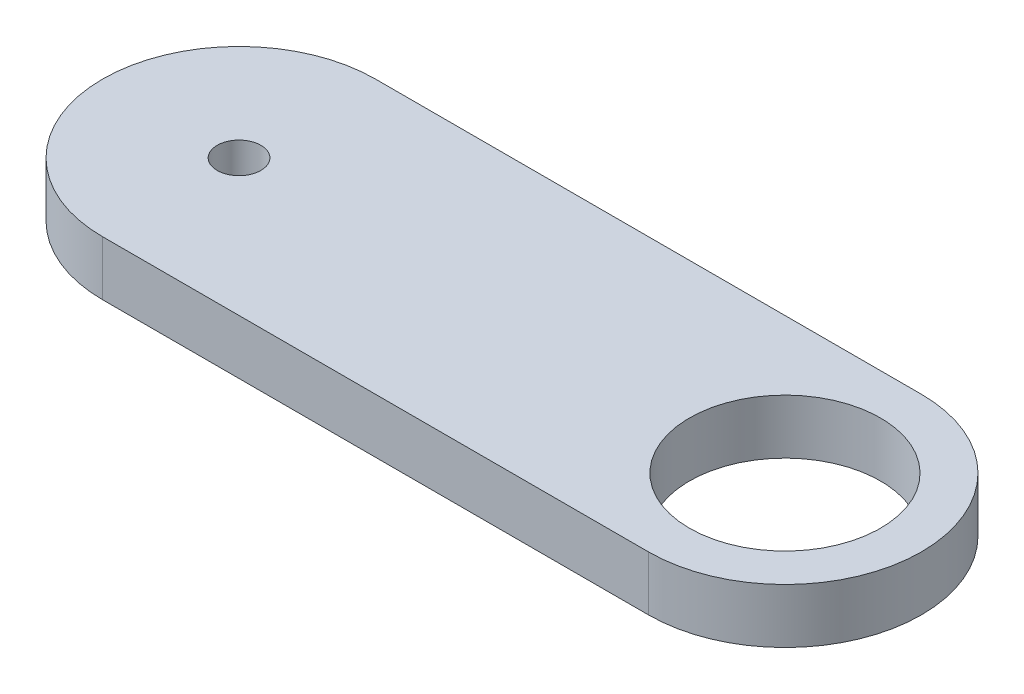
ISO-10303-21;
HEADER;
FILE_DESCRIPTION(('STEP AP214'),'2;1');
FILE_NAME('part.step','',(''),(''),'','','');
FILE_SCHEMA(('AUTOMOTIVE_DESIGN { 1 0 10303 214 1 1 1 1 }'));
ENDSEC;
DATA;
#1=APPLICATION_CONTEXT('core data for automotive mechanical design processes');
#2=APPLICATION_PROTOCOL_DEFINITION('international standard','automotive_design',2000,#1);
#3=PRODUCT_CONTEXT('',#1,'mechanical');
#4=PRODUCT('Part','Part','',(#3));
#5=PRODUCT_RELATED_PRODUCT_CATEGORY('part','',(#4));
#6=PRODUCT_DEFINITION_FORMATION('','',#4);
#7=PRODUCT_DEFINITION_CONTEXT('part definition',#1,'design');
#8=PRODUCT_DEFINITION('design','',#6,#7);
#9=PRODUCT_DEFINITION_SHAPE('','',#8);
#10=(LENGTH_UNIT() NAMED_UNIT(*) SI_UNIT(.MILLI.,.METRE.));
#11=(NAMED_UNIT(*) PLANE_ANGLE_UNIT() SI_UNIT($,.RADIAN.));
#12=(NAMED_UNIT(*) SI_UNIT($,.STERADIAN.) SOLID_ANGLE_UNIT());
#13=UNCERTAINTY_MEASURE_WITH_UNIT(LENGTH_MEASURE(1.E-05),#10,'distance_accuracy_value','');
#14=(GEOMETRIC_REPRESENTATION_CONTEXT(3) GLOBAL_UNCERTAINTY_ASSIGNED_CONTEXT((#13)) GLOBAL_UNIT_ASSIGNED_CONTEXT((#10,
#11,#12)) REPRESENTATION_CONTEXT('',''));
#15=CARTESIAN_POINT('',(0.,0.,0.));
#16=DIRECTION('',(0.,0.,1.));
#17=DIRECTION('',(1.,0.,0.));
#18=AXIS2_PLACEMENT_3D('',#15,#16,#17);
#19=CARTESIAN_POINT('',(0.,10.,0.));
#20=DIRECTION('',(0.,1.,0.));
#21=DIRECTION('',(0.,0.,1.));
#22=AXIS2_PLACEMENT_3D('',#19,#20,#21);
#23=PLANE('',#22);
#24=CARTESIAN_POINT('',(0.,10.,0.));
#25=DIRECTION('',(0.,1.,0.));
#26=DIRECTION('',(0.,0.,1.));
#27=AXIS2_PLACEMENT_3D('',#24,#25,#26);
#28=CIRCLE('',#27,4.);
#29=CARTESIAN_POINT('',(0.,10.,4.));
#30=VERTEX_POINT('',#29);
#31=EDGE_CURVE('E100',#30,#30,#28,.T.);
#32=ORIENTED_EDGE('',*,*,#31,.F.);
#33=EDGE_LOOP('',(#32));
#34=FACE_BOUND('',#33,.T.);
#35=CARTESIAN_POINT('',(0.,10.,0.));
#36=DIRECTION('',(0.,1.,0.));
#37=DIRECTION('',(0.,0.,1.));
#38=AXIS2_PLACEMENT_3D('',#35,#36,#37);
#39=CIRCLE('',#38,25.);
#40=CARTESIAN_POINT('',(0.,10.,-25.));
#41=VERTEX_POINT('',#40);
#42=CARTESIAN_POINT('',(0.,10.,25.));
#43=VERTEX_POINT('',#42);
#44=EDGE_CURVE('E85',#41,#43,#39,.T.);
#45=ORIENTED_EDGE('',*,*,#44,.T.);
#46=DIRECTION('',(1.,0.,0.));
#47=VECTOR('',#46,1.);
#48=CARTESIAN_POINT('',(0.,10.,25.));
#49=LINE('',#48,#47);
#50=CARTESIAN_POINT('',(100.,10.,25.));
#51=VERTEX_POINT('',#50);
#52=EDGE_CURVE('E80',#43,#51,#49,.T.);
#53=ORIENTED_EDGE('',*,*,#52,.T.);
#54=CARTESIAN_POINT('',(100.,10.,0.));
#55=DIRECTION('',(0.,1.,0.));
#56=DIRECTION('',(0.,0.,1.));
#57=AXIS2_PLACEMENT_3D('',#54,#55,#56);
#58=CIRCLE('',#57,25.);
#59=CARTESIAN_POINT('',(100.,10.,-25.));
#60=VERTEX_POINT('',#59);
#61=EDGE_CURVE('E83',#51,#60,#58,.T.);
#62=ORIENTED_EDGE('',*,*,#61,.T.);
#63=DIRECTION('',(-1.,0.,0.));
#64=VECTOR('',#63,1.);
#65=CARTESIAN_POINT('',(0.,10.,-25.));
#66=LINE('',#65,#64);
#67=EDGE_CURVE('E50',#60,#41,#66,.T.);
#68=ORIENTED_EDGE('',*,*,#67,.T.);
#69=EDGE_LOOP('',(#45,#53,#62,#68));
#70=FACE_BOUND('',#69,.T.);
#71=CARTESIAN_POINT('',(100.,10.,0.));
#72=DIRECTION('',(0.,1.,0.));
#73=DIRECTION('',(0.,0.,1.));
#74=AXIS2_PLACEMENT_3D('',#71,#72,#73);
#75=CIRCLE('',#74,17.5);
#76=CARTESIAN_POINT('',(100.,10.,17.5));
#77=VERTEX_POINT('',#76);
#78=EDGE_CURVE('E115',#77,#77,#75,.T.);
#79=ORIENTED_EDGE('',*,*,#78,.F.);
#80=EDGE_LOOP('',(#79));
#81=FACE_BOUND('',#80,.T.);
#82=ADVANCED_FACE('F33',(#34,#70,#81),#23,.T.);
#83=CARTESIAN_POINT('',(0.,0.,0.));
#84=DIRECTION('',(0.,1.,0.));
#85=DIRECTION('',(0.,0.,1.));
#86=AXIS2_PLACEMENT_3D('',#83,#84,#85);
#87=PLANE('',#86);
#88=CARTESIAN_POINT('',(0.,0.,0.));
#89=DIRECTION('',(0.,1.,0.));
#90=DIRECTION('',(0.,0.,1.));
#91=AXIS2_PLACEMENT_3D('',#88,#89,#90);
#92=CIRCLE('',#91,25.);
#93=CARTESIAN_POINT('',(0.,0.,-25.));
#94=VERTEX_POINT('',#93);
#95=CARTESIAN_POINT('',(0.,0.,25.));
#96=VERTEX_POINT('',#95);
#97=EDGE_CURVE('E97',#94,#96,#92,.T.);
#98=ORIENTED_EDGE('',*,*,#97,.F.);
#99=DIRECTION('',(-1.,0.,0.));
#100=VECTOR('',#99,1.);
#101=CARTESIAN_POINT('',(0.,0.,-25.));
#102=LINE('',#101,#100);
#103=CARTESIAN_POINT('',(100.,0.,-25.));
#104=VERTEX_POINT('',#103);
#105=EDGE_CURVE('E73',#104,#94,#102,.T.);
#106=ORIENTED_EDGE('',*,*,#105,.F.);
#107=CARTESIAN_POINT('',(100.,0.,0.));
#108=DIRECTION('',(0.,1.,0.));
#109=DIRECTION('',(0.,0.,1.));
#110=AXIS2_PLACEMENT_3D('',#107,#108,#109);
#111=CIRCLE('',#110,25.);
#112=CARTESIAN_POINT('',(100.,0.,25.));
#113=VERTEX_POINT('',#112);
#114=EDGE_CURVE('E67',#113,#104,#111,.T.);
#115=ORIENTED_EDGE('',*,*,#114,.F.);
#116=DIRECTION('',(1.,0.,0.));
#117=VECTOR('',#116,1.);
#118=CARTESIAN_POINT('',(0.,0.,25.));
#119=LINE('',#118,#117);
#120=EDGE_CURVE('E89',#96,#113,#119,.T.);
#121=ORIENTED_EDGE('',*,*,#120,.F.);
#122=EDGE_LOOP('',(#98,#106,#115,#121));
#123=FACE_BOUND('',#122,.T.);
#124=CARTESIAN_POINT('',(0.,0.,0.));
#125=DIRECTION('',(0.,1.,0.));
#126=DIRECTION('',(0.,0.,1.));
#127=AXIS2_PLACEMENT_3D('',#124,#125,#126);
#128=CIRCLE('',#127,4.);
#129=CARTESIAN_POINT('',(0.,0.,4.));
#130=VERTEX_POINT('',#129);
#131=EDGE_CURVE('E112',#130,#130,#128,.T.);
#132=ORIENTED_EDGE('',*,*,#131,.T.);
#133=EDGE_LOOP('',(#132));
#134=FACE_BOUND('',#133,.T.);
#135=CARTESIAN_POINT('',(100.,0.,0.));
#136=DIRECTION('',(0.,1.,0.));
#137=DIRECTION('',(0.,0.,1.));
#138=AXIS2_PLACEMENT_3D('',#135,#136,#137);
#139=CIRCLE('',#138,17.5);
#140=CARTESIAN_POINT('',(100.,0.,17.5));
#141=VERTEX_POINT('',#140);
#142=EDGE_CURVE('E118',#141,#141,#139,.T.);
#143=ORIENTED_EDGE('',*,*,#142,.T.);
#144=EDGE_LOOP('',(#143));
#145=FACE_BOUND('',#144,.T.);
#146=ADVANCED_FACE('F108',(#123,#134,#145),#87,.F.);
#147=CARTESIAN_POINT('',(0.,10.,0.));
#148=DIRECTION('',(0.,-1.,0.));
#149=DIRECTION('',(0.,0.,-1.));
#150=AXIS2_PLACEMENT_3D('',#147,#148,#149);
#151=CYLINDRICAL_SURFACE('',#150,25.);
#152=ORIENTED_EDGE('',*,*,#97,.T.);
#153=DIRECTION('',(0.,-1.,0.));
#154=VECTOR('',#153,1.);
#155=CARTESIAN_POINT('',(0.,10.,25.));
#156=LINE('',#155,#154);
#157=EDGE_CURVE('E11',#43,#96,#156,.T.);
#158=ORIENTED_EDGE('',*,*,#157,.F.);
#159=ORIENTED_EDGE('',*,*,#44,.F.);
#160=DIRECTION('',(0.,-1.,0.));
#161=VECTOR('',#160,1.);
#162=CARTESIAN_POINT('',(0.,10.,-25.));
#163=LINE('',#162,#161);
#164=EDGE_CURVE('E93',#41,#94,#163,.T.);
#165=ORIENTED_EDGE('',*,*,#164,.T.);
#166=EDGE_LOOP('',(#152,#158,#159,#165));
#167=FACE_BOUND('',#166,.T.);
#168=ADVANCED_FACE('F35',(#167),#151,.T.);
#169=CARTESIAN_POINT('',(0.,10.,25.));
#170=DIRECTION('',(0.,0.,-1.));
#171=DIRECTION('',(-1.,0.,0.));
#172=AXIS2_PLACEMENT_3D('',#169,#170,#171);
#173=PLANE('',#172);
#174=ORIENTED_EDGE('',*,*,#120,.T.);
#175=DIRECTION('',(0.,-1.,0.));
#176=VECTOR('',#175,1.);
#177=CARTESIAN_POINT('',(100.,10.,25.));
#178=LINE('',#177,#176);
#179=EDGE_CURVE('E42',#51,#113,#178,.T.);
#180=ORIENTED_EDGE('',*,*,#179,.F.);
#181=ORIENTED_EDGE('',*,*,#52,.F.);
#182=ORIENTED_EDGE('',*,*,#157,.T.);
#183=EDGE_LOOP('',(#174,#180,#181,#182));
#184=FACE_BOUND('',#183,.T.);
#185=ADVANCED_FACE('F88',(#184),#173,.F.);
#186=CARTESIAN_POINT('',(100.,10.,0.));
#187=DIRECTION('',(0.,-1.,0.));
#188=DIRECTION('',(0.,0.,-1.));
#189=AXIS2_PLACEMENT_3D('',#186,#187,#188);
#190=CYLINDRICAL_SURFACE('',#189,25.);
#191=ORIENTED_EDGE('',*,*,#114,.T.);
#192=DIRECTION('',(0.,-1.,0.));
#193=VECTOR('',#192,1.);
#194=CARTESIAN_POINT('',(100.,10.,-25.));
#195=LINE('',#194,#193);
#196=EDGE_CURVE('E90',#60,#104,#195,.T.);
#197=ORIENTED_EDGE('',*,*,#196,.F.);
#198=ORIENTED_EDGE('',*,*,#61,.F.);
#199=ORIENTED_EDGE('',*,*,#179,.T.);
#200=EDGE_LOOP('',(#191,#197,#198,#199));
#201=FACE_BOUND('',#200,.T.);
#202=ADVANCED_FACE('F91',(#201),#190,.T.);
#203=CARTESIAN_POINT('',(0.,10.,-25.));
#204=DIRECTION('',(0.,0.,1.));
#205=DIRECTION('',(1.,0.,0.));
#206=AXIS2_PLACEMENT_3D('',#203,#204,#205);
#207=PLANE('',#206);
#208=ORIENTED_EDGE('',*,*,#105,.T.);
#209=ORIENTED_EDGE('',*,*,#164,.F.);
#210=ORIENTED_EDGE('',*,*,#67,.F.);
#211=ORIENTED_EDGE('',*,*,#196,.T.);
#212=EDGE_LOOP('',(#208,#209,#210,#211));
#213=FACE_BOUND('',#212,.T.);
#214=ADVANCED_FACE('F105',(#213),#207,.F.);
#215=CARTESIAN_POINT('',(0.,10.,0.));
#216=DIRECTION('',(0.,-1.,0.));
#217=DIRECTION('',(0.,0.,-1.));
#218=AXIS2_PLACEMENT_3D('',#215,#216,#217);
#219=CYLINDRICAL_SURFACE('',#218,4.);
#220=ORIENTED_EDGE('',*,*,#31,.T.);
#221=EDGE_LOOP('',(#220));
#222=FACE_BOUND('',#221,.T.);
#223=ORIENTED_EDGE('',*,*,#131,.F.);
#224=EDGE_LOOP('',(#223));
#225=FACE_BOUND('',#224,.T.);
#226=ADVANCED_FACE('F135',(#222,#225),#219,.F.);
#227=CARTESIAN_POINT('',(100.,10.,0.));
#228=DIRECTION('',(0.,-1.,0.));
#229=DIRECTION('',(0.,0.,-1.));
#230=AXIS2_PLACEMENT_3D('',#227,#228,#229);
#231=CYLINDRICAL_SURFACE('',#230,17.5);
#232=ORIENTED_EDGE('',*,*,#78,.T.);
#233=EDGE_LOOP('',(#232));
#234=FACE_BOUND('',#233,.T.);
#235=ORIENTED_EDGE('',*,*,#142,.F.);
#236=EDGE_LOOP('',(#235));
#237=FACE_BOUND('',#236,.T.);
#238=ADVANCED_FACE('F124',(#234,#237),#231,.F.);
#239=CLOSED_SHELL('',(#82,#146,#168,#185,#202,#214,#226,#238));
#240=MANIFOLD_SOLID_BREP('B2',#239);
#241=ADVANCED_BREP_SHAPE_REPRESENTATION('',(#18,#240),#14);
#242=SHAPE_DEFINITION_REPRESENTATION(#9,#241);
ENDSEC;
END-ISO-10303-21;
